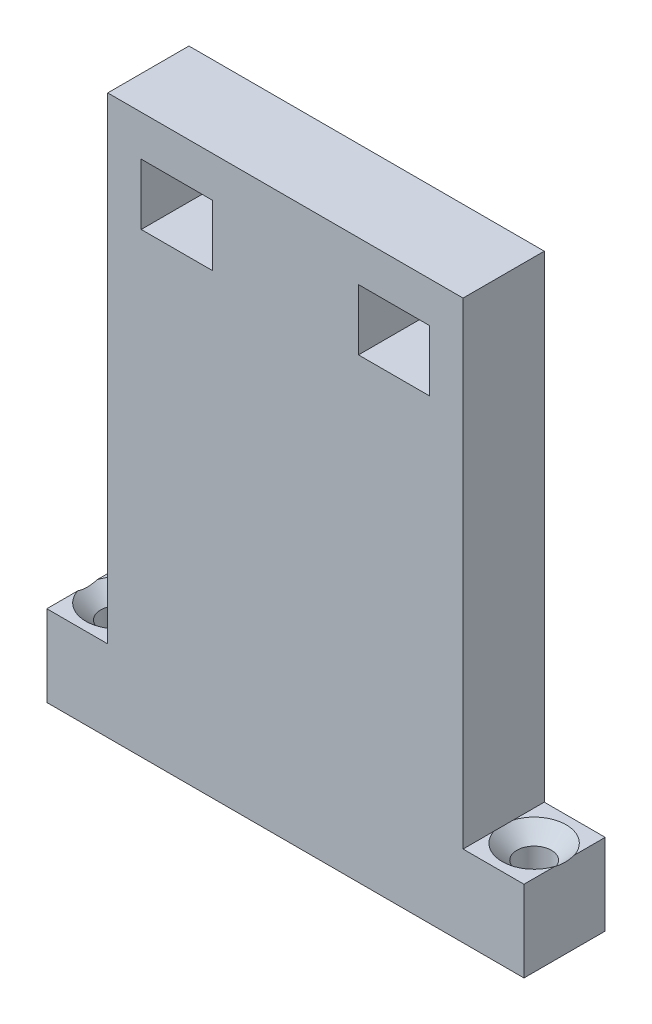
ISO-10303-21;
HEADER;
FILE_DESCRIPTION(('STEP AP214'),'2;1');
FILE_NAME('part.step','',(''),(''),'','','');
FILE_SCHEMA(('AUTOMOTIVE_DESIGN { 1 0 10303 214 1 1 1 1 }'));
ENDSEC;
DATA;
#1=APPLICATION_CONTEXT('core data for automotive mechanical design processes');
#2=APPLICATION_PROTOCOL_DEFINITION('international standard','automotive_design',2000,#1);
#3=PRODUCT_CONTEXT('',#1,'mechanical');
#4=PRODUCT('Part','Part','',(#3));
#5=PRODUCT_RELATED_PRODUCT_CATEGORY('part','',(#4));
#6=PRODUCT_DEFINITION_FORMATION('','',#4);
#7=PRODUCT_DEFINITION_CONTEXT('part definition',#1,'design');
#8=PRODUCT_DEFINITION('design','',#6,#7);
#9=PRODUCT_DEFINITION_SHAPE('','',#8);
#10=(LENGTH_UNIT() NAMED_UNIT(*) SI_UNIT(.MILLI.,.METRE.));
#11=(NAMED_UNIT(*) PLANE_ANGLE_UNIT() SI_UNIT($,.RADIAN.));
#12=(NAMED_UNIT(*) SI_UNIT($,.STERADIAN.) SOLID_ANGLE_UNIT());
#13=UNCERTAINTY_MEASURE_WITH_UNIT(LENGTH_MEASURE(1.E-05),#10,'distance_accuracy_value','');
#14=(GEOMETRIC_REPRESENTATION_CONTEXT(3) GLOBAL_UNCERTAINTY_ASSIGNED_CONTEXT((#13)) GLOBAL_UNIT_ASSIGNED_CONTEXT((#10,
#11,#12)) REPRESENTATION_CONTEXT('',''));
#15=CARTESIAN_POINT('',(0.,0.,0.));
#16=DIRECTION('',(0.,0.,1.));
#17=DIRECTION('',(1.,0.,0.));
#18=AXIS2_PLACEMENT_3D('',#15,#16,#17);
#19=CARTESIAN_POINT('',(-23.5,8.,8.));
#20=DIRECTION('',(0.,-1.,0.));
#21=DIRECTION('',(0.,0.,-1.));
#22=AXIS2_PLACEMENT_3D('',#19,#20,#21);
#23=PLANE('',#22);
#24=DIRECTION('',(0.,0.,-1.));
#25=VECTOR('',#24,1.);
#26=CARTESIAN_POINT('',(-17.5,8.,8.));
#27=LINE('',#26,#25);
#28=CARTESIAN_POINT('',(-17.5,8.,8.));
#29=VERTEX_POINT('',#28);
#30=CARTESIAN_POINT('',(-17.5,8.,4.96046863561493));
#31=VERTEX_POINT('',#30);
#32=EDGE_CURVE('E192',#29,#31,#27,.T.);
#33=ORIENTED_EDGE('',*,*,#32,.T.);
#34=CARTESIAN_POINT('',(-20.5,8.,4.));
#35=DIRECTION('',(0.,1.,0.));
#36=DIRECTION('',(0.,0.,1.));
#37=AXIS2_PLACEMENT_3D('',#34,#35,#36);
#38=CIRCLE('',#37,3.15);
#39=CARTESIAN_POINT('',(-23.5,8.,4.96046863561493));
#40=VERTEX_POINT('',#39);
#41=EDGE_CURVE('E171',#40,#31,#38,.T.);
#42=ORIENTED_EDGE('',*,*,#41,.F.);
#43=DIRECTION('',(0.,0.,-1.));
#44=VECTOR('',#43,1.);
#45=CARTESIAN_POINT('',(-23.5,8.,8.));
#46=LINE('',#45,#44);
#47=CARTESIAN_POINT('',(-23.5,8.,8.));
#48=VERTEX_POINT('',#47);
#49=EDGE_CURVE('E202',#48,#40,#46,.T.);
#50=ORIENTED_EDGE('',*,*,#49,.F.);
#51=DIRECTION('',(-1.,0.,0.));
#52=VECTOR('',#51,1.);
#53=CARTESIAN_POINT('',(-23.5,8.,8.));
#54=LINE('',#53,#52);
#55=EDGE_CURVE('E196',#29,#48,#54,.T.);
#56=ORIENTED_EDGE('',*,*,#55,.F.);
#57=EDGE_LOOP('',(#33,#42,#50,#56));
#58=FACE_BOUND('',#57,.T.);
#59=ADVANCED_FACE('F33',(#58),#23,.F.);
#60=CARTESIAN_POINT('',(23.5,8.,8.));
#61=DIRECTION('',(0.,-1.,0.));
#62=DIRECTION('',(0.,0.,-1.));
#63=AXIS2_PLACEMENT_3D('',#60,#61,#62);
#64=PLANE('',#63);
#65=DIRECTION('',(0.,0.,-1.));
#66=VECTOR('',#65,1.);
#67=CARTESIAN_POINT('',(23.5,8.,8.));
#68=LINE('',#67,#66);
#69=CARTESIAN_POINT('',(23.5,8.,8.));
#70=VERTEX_POINT('',#69);
#71=CARTESIAN_POINT('',(23.5,8.,4.96046863561493));
#72=VERTEX_POINT('',#71);
#73=EDGE_CURVE('E527',#70,#72,#68,.T.);
#74=ORIENTED_EDGE('',*,*,#73,.T.);
#75=CARTESIAN_POINT('',(20.5,8.,4.));
#76=DIRECTION('',(0.,1.,0.));
#77=DIRECTION('',(0.,0.,1.));
#78=AXIS2_PLACEMENT_3D('',#75,#76,#77);
#79=CIRCLE('',#78,3.15);
#80=CARTESIAN_POINT('',(17.5,8.,4.96046863561493));
#81=VERTEX_POINT('',#80);
#82=EDGE_CURVE('E57',#81,#72,#79,.T.);
#83=ORIENTED_EDGE('',*,*,#82,.F.);
#84=DIRECTION('',(0.,0.,-1.));
#85=VECTOR('',#84,1.);
#86=CARTESIAN_POINT('',(17.5,8.,8.));
#87=LINE('',#86,#85);
#88=CARTESIAN_POINT('',(17.5,8.,8.));
#89=VERTEX_POINT('',#88);
#90=EDGE_CURVE('E524',#89,#81,#87,.T.);
#91=ORIENTED_EDGE('',*,*,#90,.F.);
#92=DIRECTION('',(-1.,0.,0.));
#93=VECTOR('',#92,1.);
#94=CARTESIAN_POINT('',(23.5,8.,8.));
#95=LINE('',#94,#93);
#96=EDGE_CURVE('E237',#70,#89,#95,.T.);
#97=ORIENTED_EDGE('',*,*,#96,.F.);
#98=EDGE_LOOP('',(#74,#83,#91,#97));
#99=FACE_BOUND('',#98,.T.);
#100=ADVANCED_FACE('F370',(#99),#64,.F.);
#101=CARTESIAN_POINT('',(0.,0.,8.));
#102=DIRECTION('',(0.,0.,-1.));
#103=DIRECTION('',(-1.,0.,0.));
#104=AXIS2_PLACEMENT_3D('',#101,#102,#103);
#105=PLANE('',#104);
#106=DIRECTION('',(0.,-1.,0.));
#107=VECTOR('',#106,1.);
#108=CARTESIAN_POINT('',(-14.2,51.,8.));
#109=LINE('',#108,#107);
#110=CARTESIAN_POINT('',(-14.2,51.,8.));
#111=VERTEX_POINT('',#110);
#112=CARTESIAN_POINT('',(-14.2,45.,8.));
#113=VERTEX_POINT('',#112);
#114=EDGE_CURVE('E258',#111,#113,#109,.T.);
#115=ORIENTED_EDGE('',*,*,#114,.F.);
#116=DIRECTION('',(-1.,0.,0.));
#117=VECTOR('',#116,1.);
#118=CARTESIAN_POINT('',(-14.2,51.,8.));
#119=LINE('',#118,#117);
#120=CARTESIAN_POINT('',(-7.2,51.,8.));
#121=VERTEX_POINT('',#120);
#122=EDGE_CURVE('E254',#121,#111,#119,.T.);
#123=ORIENTED_EDGE('',*,*,#122,.F.);
#124=DIRECTION('',(0.,1.,0.));
#125=VECTOR('',#124,1.);
#126=CARTESIAN_POINT('',(-7.2,51.,8.));
#127=LINE('',#126,#125);
#128=CARTESIAN_POINT('',(-7.2,45.,8.));
#129=VERTEX_POINT('',#128);
#130=EDGE_CURVE('E270',#129,#121,#127,.T.);
#131=ORIENTED_EDGE('',*,*,#130,.F.);
#132=DIRECTION('',(1.,0.,0.));
#133=VECTOR('',#132,1.);
#134=CARTESIAN_POINT('',(-14.2,45.,8.));
#135=LINE('',#134,#133);
#136=EDGE_CURVE('E273',#113,#129,#135,.T.);
#137=ORIENTED_EDGE('',*,*,#136,.F.);
#138=EDGE_LOOP('',(#115,#123,#131,#137));
#139=FACE_BOUND('',#138,.T.);
#140=DIRECTION('',(0.,-1.,0.));
#141=VECTOR('',#140,1.);
#142=CARTESIAN_POINT('',(-23.5,0.,8.));
#143=LINE('',#142,#141);
#144=CARTESIAN_POINT('',(-23.5,0.,8.));
#145=VERTEX_POINT('',#144);
#146=EDGE_CURVE('E211',#48,#145,#143,.T.);
#147=ORIENTED_EDGE('',*,*,#146,.T.);
#148=DIRECTION('',(1.,0.,0.));
#149=VECTOR('',#148,1.);
#150=CARTESIAN_POINT('',(23.5,0.,8.));
#151=LINE('',#150,#149);
#152=CARTESIAN_POINT('',(23.5,0.,8.));
#153=VERTEX_POINT('',#152);
#154=EDGE_CURVE('E241',#145,#153,#151,.T.);
#155=ORIENTED_EDGE('',*,*,#154,.T.);
#156=DIRECTION('',(0.,1.,0.));
#157=VECTOR('',#156,1.);
#158=CARTESIAN_POINT('',(23.5,0.,8.));
#159=LINE('',#158,#157);
#160=EDGE_CURVE('E239',#153,#70,#159,.T.);
#161=ORIENTED_EDGE('',*,*,#160,.T.);
#162=ORIENTED_EDGE('',*,*,#96,.T.);
#163=DIRECTION('',(0.,1.,0.));
#164=VECTOR('',#163,1.);
#165=CARTESIAN_POINT('',(17.5,8.,8.));
#166=LINE('',#165,#164);
#167=CARTESIAN_POINT('',(17.5,55.,8.));
#168=VERTEX_POINT('',#167);
#169=EDGE_CURVE('E235',#89,#168,#166,.T.);
#170=ORIENTED_EDGE('',*,*,#169,.T.);
#171=DIRECTION('',(-1.,0.,0.));
#172=VECTOR('',#171,1.);
#173=CARTESIAN_POINT('',(-17.5,55.,8.));
#174=LINE('',#173,#172);
#175=CARTESIAN_POINT('',(-17.5,55.,8.));
#176=VERTEX_POINT('',#175);
#177=EDGE_CURVE('E233',#168,#176,#174,.T.);
#178=ORIENTED_EDGE('',*,*,#177,.T.);
#179=DIRECTION('',(0.,-1.,0.));
#180=VECTOR('',#179,1.);
#181=CARTESIAN_POINT('',(-17.5,8.,8.));
#182=LINE('',#181,#180);
#183=EDGE_CURVE('E231',#176,#29,#182,.T.);
#184=ORIENTED_EDGE('',*,*,#183,.T.);
#185=ORIENTED_EDGE('',*,*,#55,.T.);
#186=EDGE_LOOP('',(#147,#155,#161,#162,#170,#178,#184,#185));
#187=FACE_BOUND('',#186,.T.);
#188=DIRECTION('',(-1.,0.,0.));
#189=VECTOR('',#188,1.);
#190=CARTESIAN_POINT('',(14.2,51.,8.));
#191=LINE('',#190,#189);
#192=CARTESIAN_POINT('',(14.2,51.,8.));
#193=VERTEX_POINT('',#192);
#194=CARTESIAN_POINT('',(7.2,51.,8.));
#195=VERTEX_POINT('',#194);
#196=EDGE_CURVE('E289',#193,#195,#191,.T.);
#197=ORIENTED_EDGE('',*,*,#196,.F.);
#198=DIRECTION('',(0.,1.,0.));
#199=VECTOR('',#198,1.);
#200=CARTESIAN_POINT('',(14.2,51.,8.));
#201=LINE('',#200,#199);
#202=CARTESIAN_POINT('',(14.2,45.,8.));
#203=VERTEX_POINT('',#202);
#204=EDGE_CURVE('E285',#203,#193,#201,.T.);
#205=ORIENTED_EDGE('',*,*,#204,.F.);
#206=DIRECTION('',(1.,0.,0.));
#207=VECTOR('',#206,1.);
#208=CARTESIAN_POINT('',(14.2,45.,8.));
#209=LINE('',#208,#207);
#210=CARTESIAN_POINT('',(7.2,45.,8.));
#211=VERTEX_POINT('',#210);
#212=EDGE_CURVE('E301',#211,#203,#209,.T.);
#213=ORIENTED_EDGE('',*,*,#212,.F.);
#214=DIRECTION('',(0.,-1.,0.));
#215=VECTOR('',#214,1.);
#216=CARTESIAN_POINT('',(7.2,51.,8.));
#217=LINE('',#216,#215);
#218=EDGE_CURVE('E304',#195,#211,#217,.T.);
#219=ORIENTED_EDGE('',*,*,#218,.F.);
#220=EDGE_LOOP('',(#197,#205,#213,#219));
#221=FACE_BOUND('',#220,.T.);
#222=ADVANCED_FACE('F366',(#139,#187,#221),#105,.F.);
#223=CARTESIAN_POINT('',(0.,0.,0.));
#224=DIRECTION('',(0.,0.,-1.));
#225=DIRECTION('',(-1.,0.,0.));
#226=AXIS2_PLACEMENT_3D('',#223,#224,#225);
#227=PLANE('',#226);
#228=DIRECTION('',(0.,-1.,0.));
#229=VECTOR('',#228,1.);
#230=CARTESIAN_POINT('',(-23.5,0.,0.));
#231=LINE('',#230,#229);
#232=CARTESIAN_POINT('',(-23.5,8.,0.));
#233=VERTEX_POINT('',#232);
#234=CARTESIAN_POINT('',(-23.5,0.,0.));
#235=VERTEX_POINT('',#234);
#236=EDGE_CURVE('E226',#233,#235,#231,.T.);
#237=ORIENTED_EDGE('',*,*,#236,.F.);
#238=DIRECTION('',(-1.,0.,0.));
#239=VECTOR('',#238,1.);
#240=CARTESIAN_POINT('',(-23.5,8.,0.));
#241=LINE('',#240,#239);
#242=CARTESIAN_POINT('',(-17.5,8.,0.));
#243=VERTEX_POINT('',#242);
#244=EDGE_CURVE('E209',#243,#233,#241,.T.);
#245=ORIENTED_EDGE('',*,*,#244,.F.);
#246=DIRECTION('',(0.,-1.,0.));
#247=VECTOR('',#246,1.);
#248=CARTESIAN_POINT('',(-17.5,8.,0.));
#249=LINE('',#248,#247);
#250=CARTESIAN_POINT('',(-17.5,55.,0.));
#251=VERTEX_POINT('',#250);
#252=EDGE_CURVE('E212',#251,#243,#249,.T.);
#253=ORIENTED_EDGE('',*,*,#252,.F.);
#254=DIRECTION('',(-1.,0.,0.));
#255=VECTOR('',#254,1.);
#256=CARTESIAN_POINT('',(-17.5,55.,0.));
#257=LINE('',#256,#255);
#258=CARTESIAN_POINT('',(17.5,55.,0.));
#259=VERTEX_POINT('',#258);
#260=EDGE_CURVE('E214',#259,#251,#257,.T.);
#261=ORIENTED_EDGE('',*,*,#260,.F.);
#262=DIRECTION('',(0.,1.,0.));
#263=VECTOR('',#262,1.);
#264=CARTESIAN_POINT('',(17.5,8.,0.));
#265=LINE('',#264,#263);
#266=CARTESIAN_POINT('',(17.5,8.,0.));
#267=VERTEX_POINT('',#266);
#268=EDGE_CURVE('E216',#267,#259,#265,.T.);
#269=ORIENTED_EDGE('',*,*,#268,.F.);
#270=DIRECTION('',(-1.,0.,0.));
#271=VECTOR('',#270,1.);
#272=CARTESIAN_POINT('',(23.5,8.,0.));
#273=LINE('',#272,#271);
#274=CARTESIAN_POINT('',(23.5,8.,0.));
#275=VERTEX_POINT('',#274);
#276=EDGE_CURVE('E218',#275,#267,#273,.T.);
#277=ORIENTED_EDGE('',*,*,#276,.F.);
#278=DIRECTION('',(0.,1.,0.));
#279=VECTOR('',#278,1.);
#280=CARTESIAN_POINT('',(23.5,0.,0.));
#281=LINE('',#280,#279);
#282=CARTESIAN_POINT('',(23.5,0.,0.));
#283=VERTEX_POINT('',#282);
#284=EDGE_CURVE('E221',#283,#275,#281,.T.);
#285=ORIENTED_EDGE('',*,*,#284,.F.);
#286=DIRECTION('',(1.,0.,0.));
#287=VECTOR('',#286,1.);
#288=CARTESIAN_POINT('',(23.5,0.,0.));
#289=LINE('',#288,#287);
#290=EDGE_CURVE('E224',#235,#283,#289,.T.);
#291=ORIENTED_EDGE('',*,*,#290,.F.);
#292=EDGE_LOOP('',(#237,#245,#253,#261,#269,#277,#285,#291));
#293=FACE_BOUND('',#292,.T.);
#294=DIRECTION('',(-1.,0.,0.));
#295=VECTOR('',#294,1.);
#296=CARTESIAN_POINT('',(-14.2,51.,0.));
#297=LINE('',#296,#295);
#298=CARTESIAN_POINT('',(-7.2,51.,0.));
#299=VERTEX_POINT('',#298);
#300=CARTESIAN_POINT('',(-14.2,51.,0.));
#301=VERTEX_POINT('',#300);
#302=EDGE_CURVE('E255',#299,#301,#297,.T.);
#303=ORIENTED_EDGE('',*,*,#302,.T.);
#304=DIRECTION('',(0.,-1.,0.));
#305=VECTOR('',#304,1.);
#306=CARTESIAN_POINT('',(-14.2,51.,0.));
#307=LINE('',#306,#305);
#308=CARTESIAN_POINT('',(-14.2,45.,0.));
#309=VERTEX_POINT('',#308);
#310=EDGE_CURVE('E265',#301,#309,#307,.T.);
#311=ORIENTED_EDGE('',*,*,#310,.T.);
#312=DIRECTION('',(1.,0.,0.));
#313=VECTOR('',#312,1.);
#314=CARTESIAN_POINT('',(-14.2,45.,0.));
#315=LINE('',#314,#313);
#316=CARTESIAN_POINT('',(-7.2,45.,0.));
#317=VERTEX_POINT('',#316);
#318=EDGE_CURVE('E262',#309,#317,#315,.T.);
#319=ORIENTED_EDGE('',*,*,#318,.T.);
#320=DIRECTION('',(0.,1.,0.));
#321=VECTOR('',#320,1.);
#322=CARTESIAN_POINT('',(-7.2,51.,0.));
#323=LINE('',#322,#321);
#324=EDGE_CURVE('E259',#317,#299,#323,.T.);
#325=ORIENTED_EDGE('',*,*,#324,.T.);
#326=EDGE_LOOP('',(#303,#311,#319,#325));
#327=FACE_BOUND('',#326,.T.);
#328=DIRECTION('',(0.,1.,0.));
#329=VECTOR('',#328,1.);
#330=CARTESIAN_POINT('',(14.2,51.,0.));
#331=LINE('',#330,#329);
#332=CARTESIAN_POINT('',(14.2,45.,0.));
#333=VERTEX_POINT('',#332);
#334=CARTESIAN_POINT('',(14.2,51.,0.));
#335=VERTEX_POINT('',#334);
#336=EDGE_CURVE('E286',#333,#335,#331,.T.);
#337=ORIENTED_EDGE('',*,*,#336,.T.);
#338=DIRECTION('',(-1.,0.,0.));
#339=VECTOR('',#338,1.);
#340=CARTESIAN_POINT('',(14.2,51.,0.));
#341=LINE('',#340,#339);
#342=CARTESIAN_POINT('',(7.2,51.,0.));
#343=VERTEX_POINT('',#342);
#344=EDGE_CURVE('E296',#335,#343,#341,.T.);
#345=ORIENTED_EDGE('',*,*,#344,.T.);
#346=DIRECTION('',(0.,-1.,0.));
#347=VECTOR('',#346,1.);
#348=CARTESIAN_POINT('',(7.2,51.,0.));
#349=LINE('',#348,#347);
#350=CARTESIAN_POINT('',(7.2,45.,0.));
#351=VERTEX_POINT('',#350);
#352=EDGE_CURVE('E293',#343,#351,#349,.T.);
#353=ORIENTED_EDGE('',*,*,#352,.T.);
#354=DIRECTION('',(1.,0.,0.));
#355=VECTOR('',#354,1.);
#356=CARTESIAN_POINT('',(14.2,45.,0.));
#357=LINE('',#356,#355);
#358=EDGE_CURVE('E290',#351,#333,#357,.T.);
#359=ORIENTED_EDGE('',*,*,#358,.T.);
#360=EDGE_LOOP('',(#337,#345,#353,#359));
#361=FACE_BOUND('',#360,.T.);
#362=ADVANCED_FACE('F369',(#293,#327,#361),#227,.T.);
#363=CARTESIAN_POINT('',(-23.5,0.,8.));
#364=DIRECTION('',(1.,0.,0.));
#365=DIRECTION('',(0.,0.,-1.));
#366=AXIS2_PLACEMENT_3D('',#363,#364,#365);
#367=PLANE('',#366);
#368=ORIENTED_EDGE('',*,*,#49,.T.);
#369=CARTESIAN_POINT('',(-23.5,14.6952486593279,-5.37704223964027));
#370=CARTESIAN_POINT('',(-23.5,14.4843740586763,-5.15561858305818));
#371=CARTESIAN_POINT('',(-23.5,14.2738433583673,-4.93386578474903));
#372=CARTESIAN_POINT('',(-23.5,13.8536773417913,-4.48949552036392));
#373=CARTESIAN_POINT('',(-23.5,13.6440420649191,-4.26687801705079));
#374=CARTESIAN_POINT('',(-23.5,13.2253713241733,-3.82003455453913));
#375=CARTESIAN_POINT('',(-23.5,13.01633866118,-3.59580596823558));
#376=CARTESIAN_POINT('',(-23.5,12.5997284559224,-3.14601184630971));
#377=CARTESIAN_POINT('',(-23.5,12.3921508728783,-2.92044634848514));
#378=CARTESIAN_POINT('',(-23.5,11.955051972803,-2.44146495592533));
#379=CARTESIAN_POINT('',(-23.5,11.7257614823849,-2.18783788872239));
#380=CARTESIAN_POINT('',(-23.5,11.2704455811407,-1.67762132188396));
#381=CARTESIAN_POINT('',(-23.5,11.0444204838787,-1.42103154195073));
#382=CARTESIAN_POINT('',(-23.5,10.5974542560683,-0.904101479107509));
#383=CARTESIAN_POINT('',(-23.5,10.3765060200008,-0.643767387099658));
#384=CARTESIAN_POINT('',(-23.5,10.0506076526672,-0.248738550352719));
#385=CARTESIAN_POINT('',(-23.5,9.94290349070518,-0.116317874293632));
#386=CARTESIAN_POINT('',(-23.5,9.72985048176005,0.150401618555466));
#387=CARTESIAN_POINT('',(-23.5,9.62450152143499,0.284700344458238));
#388=CARTESIAN_POINT('',(-23.5,9.44156921784116,0.523379349251327));
#389=CARTESIAN_POINT('',(-23.5,9.36334733253797,0.627269524612356));
#390=CARTESIAN_POINT('',(-23.5,9.20908789758965,0.836668441271106));
#391=CARTESIAN_POINT('',(-23.5,9.13305041311837,0.942177230718073));
#392=CARTESIAN_POINT('',(-23.5,8.98355241082204,1.15534844551834));
#393=CARTESIAN_POINT('',(-23.5,8.91009770666328,1.26301496753149));
#394=CARTESIAN_POINT('',(-23.5,8.76668493502439,1.48064968233338));
#395=CARTESIAN_POINT('',(-23.5,8.69672668870525,1.59061775699183));
#396=CARTESIAN_POINT('',(-23.5,8.56288848883241,1.81071003857602));
#397=CARTESIAN_POINT('',(-23.5,8.49890434729003,1.92076987981407));
#398=CARTESIAN_POINT('',(-23.5,8.3765119737352,2.14392843057681));
#399=CARTESIAN_POINT('',(-23.5,8.31810533233048,2.25702799526474));
#400=CARTESIAN_POINT('',(-23.5,8.15411681899629,2.60083321273235));
#401=CARTESIAN_POINT('',(-23.5,8.05908052814724,2.83711269473257));
#402=CARTESIAN_POINT('',(-23.5,7.96598284975868,3.15477550904268));
#403=CARTESIAN_POINT('',(-23.5,7.94637750513866,3.22993672799612));
#404=CARTESIAN_POINT('',(-23.5,7.91221849163426,3.38142917574712));
#405=CARTESIAN_POINT('',(-23.5,7.89766555827262,3.4577605732101));
#406=CARTESIAN_POINT('',(-23.5,7.87415480984103,3.61110966550563));
#407=CARTESIAN_POINT('',(-23.5,7.86518428588106,3.68812539359988));
#408=CARTESIAN_POINT('',(-23.5,7.85313800094568,3.84261652378773));
#409=CARTESIAN_POINT('',(-23.5,7.85006201985305,3.9200919086082));
#410=CARTESIAN_POINT('',(-23.5,7.84992852144673,4.08955306867226));
#411=CARTESIAN_POINT('',(-23.5,7.85410439449176,4.18154229604827));
#412=CARTESIAN_POINT('',(-23.5,7.87071560328017,4.36476897840801));
#413=CARTESIAN_POINT('',(-23.5,7.88315225163526,4.45600631158515));
#414=CARTESIAN_POINT('',(-23.5,7.91567448893329,4.63746878779153));
#415=CARTESIAN_POINT('',(-23.5,7.93579060968449,4.72768839107306));
#416=CARTESIAN_POINT('',(-23.5,7.98273350865998,4.90633798926832));
#417=CARTESIAN_POINT('',(-23.5,8.00956073993682,4.99476786292546));
#418=CARTESIAN_POINT('',(-23.5,8.10348442404991,5.27159647060199));
#419=CARTESIAN_POINT('',(-23.5,8.18108705248687,5.45645458127706));
#420=CARTESIAN_POINT('',(-23.5,8.31077482668549,5.72720338479213));
#421=CARTESIAN_POINT('',(-23.5,8.35627532142963,5.81645762198408));
#422=CARTESIAN_POINT('',(-23.5,8.45091312064806,5.99302102353546));
#423=CARTESIAN_POINT('',(-23.5,8.50004985459547,6.08033049024495));
#424=CARTESIAN_POINT('',(-23.5,8.60198623644195,6.25442893216801));
#425=CARTESIAN_POINT('',(-23.5,8.65482785909729,6.34119308373617));
#426=CARTESIAN_POINT('',(-23.5,8.76299212794374,6.51316015363818));
#427=CARTESIAN_POINT('',(-23.5,8.81831483312302,6.59836303478464));
#428=CARTESIAN_POINT('',(-23.5,8.93094656074714,6.7673250839585));
#429=CARTESIAN_POINT('',(-23.5,8.9882536629564,6.85108553637816));
#430=CARTESIAN_POINT('',(-23.5,9.10455905742248,7.01741558099916));
#431=CARTESIAN_POINT('',(-23.5,9.16355728167659,7.09998522088484));
#432=CARTESIAN_POINT('',(-23.5,9.36153651934654,7.37209852149658));
#433=CARTESIAN_POINT('',(-23.5,9.50358924761852,7.55940777501785));
#434=CARTESIAN_POINT('',(-23.5,9.7928438409328,7.93001997470902));
#435=CARTESIAN_POINT('',(-23.5,9.94004663134773,8.11332219117311));
#436=CARTESIAN_POINT('',(-23.5,10.238202142776,8.47700360977533));
#437=CARTESIAN_POINT('',(-23.5,10.3891567878954,8.65738123030408));
#438=CARTESIAN_POINT('',(-23.5,10.6937748935956,9.01583610764546));
#439=CARTESIAN_POINT('',(-23.5,10.8474384361151,9.19391329459136));
#440=CARTESIAN_POINT('',(-23.5,11.1571880869927,9.54870435215426));
#441=CARTESIAN_POINT('',(-23.5,11.3132791538452,9.72541388621864));
#442=CARTESIAN_POINT('',(-23.5,11.6270616542996,10.0774088573119));
#443=CARTESIAN_POINT('',(-23.5,11.7847531126151,10.2526942722738));
#444=CARTESIAN_POINT('',(-23.5,12.2595971941966,10.7767338039151));
#445=CARTESIAN_POINT('',(-23.5,12.5786235171242,11.1237893284714));
#446=CARTESIAN_POINT('',(-23.5,13.1811939094538,11.7731237715883));
#447=CARTESIAN_POINT('',(-23.5,13.4643685050517,12.0757469718862));
#448=CARTESIAN_POINT('',(-23.5,14.0325803773487,12.6792937482194));
#449=CARTESIAN_POINT('',(-23.5,14.317617830015,12.9802171585354));
#450=CARTESIAN_POINT('',(-23.5,14.8877788107061,13.5794298779473));
#451=CARTESIAN_POINT('',(-23.5,15.1728962906006,13.8777249493923));
#452=CARTESIAN_POINT('',(-23.5,15.7441513093984,14.4732727882743));
#453=CARTESIAN_POINT('',(-23.5,16.0302887302064,14.7705256689523));
#454=CARTESIAN_POINT('',(-23.5,16.3168043715839,15.0674117342844));
#455=B_SPLINE_CURVE_WITH_KNOTS('',3,(#369,#370,#371,#372,#373,#374,#375,#376,#377,#378,#379,
#380,#381,#382,#383,#384,#385,#386,#387,#388,#389,#390,#391,#392,#393,#394,#395,#396,#397,#398,
#399,#400,#401,#402,#403,#404,#405,#406,#407,#408,#409,#410,#411,#412,#413,#414,#415,#416,#417,
#418,#419,#420,#421,#422,#423,#424,#425,#426,#427,#428,#429,#430,#431,#432,#433,#434,#435,#436,
#437,#438,#439,#440,#441,#442,#443,#444,#445,#446,#447,#448,#449,#450,#451,#452,#453,#454),
.UNSPECIFIED.,.F.,.F.,(4,2,2,2,2,2,2,2,2,2,2,2,2,2,2,2,2,2,2,2,2,2,2,2,2,2,2,2,2,2,2,2,2,2,2,2,
2,2,2,2,2,2,4),(0.,0.917317453447048,1.83467485767189,2.75432071309026,3.67394069074387,
4.69964192959052,5.72544101681104,6.74970416971808,7.26175804655003,7.77378722797542,
8.16390113643701,8.5540266722867,8.94498045209628,9.33591421465102,9.71766347823607,
10.0995212870838,10.8594445932227,11.0923355516865,11.3252603998776,11.5576530135744,
11.7900369489711,12.0658887920992,12.341784477723,12.6187886810099,12.8958115892993,
13.495527295027,13.796045585967,14.0965168250724,14.4012374587045,14.7059653409674,
15.0104061647049,15.3148347635171,16.0199286173674,16.725149821094,17.4307404745864,
18.1363525075137,18.8436703568315,19.5509991453802,20.9651846462967,22.2085265519687,
23.4519876531173,24.6899055754289,25.9276845402326),.UNSPECIFIED.);
#456=CARTESIAN_POINT('',(-23.5,8.,3.03953136438507));
#457=VERTEX_POINT('',#456);
#458=EDGE_CURVE('E175',#40,#457,#455,.F.);
#459=ORIENTED_EDGE('',*,*,#458,.T.);
#460=EDGE_CURVE('E205',#457,#233,#46,.T.);
#461=ORIENTED_EDGE('',*,*,#460,.T.);
#462=ORIENTED_EDGE('',*,*,#236,.T.);
#463=DIRECTION('',(0.,0.,-1.));
#464=VECTOR('',#463,1.);
#465=CARTESIAN_POINT('',(-23.5,0.,8.));
#466=LINE('',#465,#464);
#467=EDGE_CURVE('E11',#145,#235,#466,.T.);
#468=ORIENTED_EDGE('',*,*,#467,.F.);
#469=ORIENTED_EDGE('',*,*,#146,.F.);
#470=EDGE_LOOP('',(#368,#459,#461,#462,#468,#469));
#471=FACE_BOUND('',#470,.T.);
#472=ADVANCED_FACE('F35',(#471),#367,.F.);
#473=CARTESIAN_POINT('',(23.5,0.,8.));
#474=DIRECTION('',(0.,1.,0.));
#475=DIRECTION('',(0.,0.,1.));
#476=AXIS2_PLACEMENT_3D('',#473,#474,#475);
#477=PLANE('',#476);
#478=CARTESIAN_POINT('',(-20.5,0.,4.));
#479=DIRECTION('',(0.,1.,0.));
#480=DIRECTION('',(0.,0.,1.));
#481=AXIS2_PLACEMENT_3D('',#478,#479,#480);
#482=CIRCLE('',#481,1.7);
#483=CARTESIAN_POINT('',(-20.5,0.,5.7));
#484=VERTEX_POINT('',#483);
#485=EDGE_CURVE('E509',#484,#484,#482,.T.);
#486=ORIENTED_EDGE('',*,*,#485,.T.);
#487=EDGE_LOOP('',(#486));
#488=FACE_BOUND('',#487,.T.);
#489=CARTESIAN_POINT('',(20.5,0.,4.));
#490=DIRECTION('',(0.,1.,0.));
#491=DIRECTION('',(0.,0.,1.));
#492=AXIS2_PLACEMENT_3D('',#489,#490,#491);
#493=CIRCLE('',#492,1.7);
#494=CARTESIAN_POINT('',(20.5,0.,5.7));
#495=VERTEX_POINT('',#494);
#496=EDGE_CURVE('E313',#495,#495,#493,.T.);
#497=ORIENTED_EDGE('',*,*,#496,.T.);
#498=EDGE_LOOP('',(#497));
#499=FACE_BOUND('',#498,.T.);
#500=ORIENTED_EDGE('',*,*,#290,.T.);
#501=DIRECTION('',(0.,0.,-1.));
#502=VECTOR('',#501,1.);
#503=CARTESIAN_POINT('',(23.5,0.,8.));
#504=LINE('',#503,#502);
#505=EDGE_CURVE('E42',#153,#283,#504,.T.);
#506=ORIENTED_EDGE('',*,*,#505,.F.);
#507=ORIENTED_EDGE('',*,*,#154,.F.);
#508=ORIENTED_EDGE('',*,*,#467,.T.);
#509=EDGE_LOOP('',(#500,#506,#507,#508));
#510=FACE_BOUND('',#509,.T.);
#511=ADVANCED_FACE('F392',(#488,#499,#510),#477,.F.);
#512=CARTESIAN_POINT('',(23.5,0.,8.));
#513=DIRECTION('',(-1.,0.,0.));
#514=DIRECTION('',(0.,0.,1.));
#515=AXIS2_PLACEMENT_3D('',#512,#513,#514);
#516=PLANE('',#515);
#517=CARTESIAN_POINT('',(23.5,8.,3.03953136438507));
#518=VERTEX_POINT('',#517);
#519=EDGE_CURVE('E531',#518,#275,#68,.T.);
#520=ORIENTED_EDGE('',*,*,#519,.F.);
#521=CARTESIAN_POINT('',(23.5,14.6952486593279,-5.37704223964027));
#522=CARTESIAN_POINT('',(23.5,14.4843740586763,-5.15561858305818));
#523=CARTESIAN_POINT('',(23.5,14.2738433583673,-4.93386578474903));
#524=CARTESIAN_POINT('',(23.5,13.8536773417913,-4.48949552036392));
#525=CARTESIAN_POINT('',(23.5,13.6440420649191,-4.26687801705079));
#526=CARTESIAN_POINT('',(23.5,13.2253713241733,-3.82003455453913));
#527=CARTESIAN_POINT('',(23.5,13.01633866118,-3.59580596823558));
#528=CARTESIAN_POINT('',(23.5,12.5997284559224,-3.14601184630971));
#529=CARTESIAN_POINT('',(23.5,12.3921508728783,-2.92044634848514));
#530=CARTESIAN_POINT('',(23.5,11.955051972803,-2.44146495592533));
#531=CARTESIAN_POINT('',(23.5,11.7257614823849,-2.18783788872239));
#532=CARTESIAN_POINT('',(23.5,11.2704455811407,-1.67762132188396));
#533=CARTESIAN_POINT('',(23.5,11.0444204838787,-1.42103154195073));
#534=CARTESIAN_POINT('',(23.5,10.5974542560683,-0.904101479107509));
#535=CARTESIAN_POINT('',(23.5,10.3765060200008,-0.643767387099658));
#536=CARTESIAN_POINT('',(23.5,10.0506076526672,-0.248738550352719));
#537=CARTESIAN_POINT('',(23.5,9.94290349070518,-0.116317874293632));
#538=CARTESIAN_POINT('',(23.5,9.72985048176005,0.150401618555466));
#539=CARTESIAN_POINT('',(23.5,9.62450152143499,0.284700344458238));
#540=CARTESIAN_POINT('',(23.5,9.44156921784116,0.523379349251327));
#541=CARTESIAN_POINT('',(23.5,9.36334733253797,0.627269524612356));
#542=CARTESIAN_POINT('',(23.5,9.20908789758965,0.836668441271106));
#543=CARTESIAN_POINT('',(23.5,9.13305041311837,0.942177230718073));
#544=CARTESIAN_POINT('',(23.5,8.98355241082204,1.15534844551834));
#545=CARTESIAN_POINT('',(23.5,8.91009770666328,1.26301496753149));
#546=CARTESIAN_POINT('',(23.5,8.76668493502439,1.48064968233338));
#547=CARTESIAN_POINT('',(23.5,8.69672668870525,1.59061775699183));
#548=CARTESIAN_POINT('',(23.5,8.56288848883241,1.81071003857602));
#549=CARTESIAN_POINT('',(23.5,8.49890434729003,1.92076987981407));
#550=CARTESIAN_POINT('',(23.5,8.3765119737352,2.14392843057681));
#551=CARTESIAN_POINT('',(23.5,8.31810533233048,2.25702799526474));
#552=CARTESIAN_POINT('',(23.5,8.15411681899629,2.60083321273235));
#553=CARTESIAN_POINT('',(23.5,8.05908052814724,2.83711269473257));
#554=CARTESIAN_POINT('',(23.5,7.96598284975868,3.15477550904268));
#555=CARTESIAN_POINT('',(23.5,7.94637750513866,3.22993672799612));
#556=CARTESIAN_POINT('',(23.5,7.91221849163426,3.38142917574712));
#557=CARTESIAN_POINT('',(23.5,7.89766555827262,3.4577605732101));
#558=CARTESIAN_POINT('',(23.5,7.87415480984103,3.61110966550563));
#559=CARTESIAN_POINT('',(23.5,7.86518428588106,3.68812539359988));
#560=CARTESIAN_POINT('',(23.5,7.85313800094568,3.84261652378773));
#561=CARTESIAN_POINT('',(23.5,7.85006201985305,3.9200919086082));
#562=CARTESIAN_POINT('',(23.5,7.84992852144673,4.08955306867226));
#563=CARTESIAN_POINT('',(23.5,7.85410439449176,4.18154229604827));
#564=CARTESIAN_POINT('',(23.5,7.87071560328017,4.36476897840801));
#565=CARTESIAN_POINT('',(23.5,7.88315225163526,4.45600631158515));
#566=CARTESIAN_POINT('',(23.5,7.91567448893329,4.63746878779153));
#567=CARTESIAN_POINT('',(23.5,7.93579060968449,4.72768839107306));
#568=CARTESIAN_POINT('',(23.5,7.98273350865998,4.90633798926832));
#569=CARTESIAN_POINT('',(23.5,8.00956073993682,4.99476786292546));
#570=CARTESIAN_POINT('',(23.5,8.10348442404991,5.27159647060199));
#571=CARTESIAN_POINT('',(23.5,8.18108705248687,5.45645458127706));
#572=CARTESIAN_POINT('',(23.5,8.31077482668549,5.72720338479213));
#573=CARTESIAN_POINT('',(23.5,8.35627532142963,5.81645762198408));
#574=CARTESIAN_POINT('',(23.5,8.45091312064806,5.99302102353546));
#575=CARTESIAN_POINT('',(23.5,8.50004985459547,6.08033049024495));
#576=CARTESIAN_POINT('',(23.5,8.60198623644195,6.25442893216801));
#577=CARTESIAN_POINT('',(23.5,8.65482785909729,6.34119308373617));
#578=CARTESIAN_POINT('',(23.5,8.76299212794374,6.51316015363818));
#579=CARTESIAN_POINT('',(23.5,8.81831483312302,6.59836303478464));
#580=CARTESIAN_POINT('',(23.5,8.93094656074714,6.7673250839585));
#581=CARTESIAN_POINT('',(23.5,8.9882536629564,6.85108553637816));
#582=CARTESIAN_POINT('',(23.5,9.10455905742248,7.01741558099916));
#583=CARTESIAN_POINT('',(23.5,9.16355728167659,7.09998522088484));
#584=CARTESIAN_POINT('',(23.5,9.36153651934654,7.37209852149658));
#585=CARTESIAN_POINT('',(23.5,9.50358924761852,7.55940777501785));
#586=CARTESIAN_POINT('',(23.5,9.7928438409328,7.93001997470902));
#587=CARTESIAN_POINT('',(23.5,9.94004663134773,8.11332219117311));
#588=CARTESIAN_POINT('',(23.5,10.238202142776,8.47700360977533));
#589=CARTESIAN_POINT('',(23.5,10.3891567878954,8.65738123030408));
#590=CARTESIAN_POINT('',(23.5,10.6937748935956,9.01583610764546));
#591=CARTESIAN_POINT('',(23.5,10.8474384361151,9.19391329459136));
#592=CARTESIAN_POINT('',(23.5,11.1571880869927,9.54870435215426));
#593=CARTESIAN_POINT('',(23.5,11.3132791538452,9.72541388621864));
#594=CARTESIAN_POINT('',(23.5,11.6270616542996,10.0774088573119));
#595=CARTESIAN_POINT('',(23.5,11.7847531126151,10.2526942722738));
#596=CARTESIAN_POINT('',(23.5,12.2595971941966,10.7767338039151));
#597=CARTESIAN_POINT('',(23.5,12.5786235171242,11.1237893284714));
#598=CARTESIAN_POINT('',(23.5,13.1811939094538,11.7731237715883));
#599=CARTESIAN_POINT('',(23.5,13.4643685050517,12.0757469718862));
#600=CARTESIAN_POINT('',(23.5,14.0325803773487,12.6792937482194));
#601=CARTESIAN_POINT('',(23.5,14.317617830015,12.9802171585354));
#602=CARTESIAN_POINT('',(23.5,14.8877788107061,13.5794298779473));
#603=CARTESIAN_POINT('',(23.5,15.1728962906006,13.8777249493923));
#604=CARTESIAN_POINT('',(23.5,15.7441513093984,14.4732727882743));
#605=CARTESIAN_POINT('',(23.5,16.0302887302064,14.7705256689523));
#606=CARTESIAN_POINT('',(23.5,16.3168043715839,15.0674117342844));
#607=B_SPLINE_CURVE_WITH_KNOTS('',3,(#521,#522,#523,#524,#525,#526,#527,#528,#529,#530,#531,
#532,#533,#534,#535,#536,#537,#538,#539,#540,#541,#542,#543,#544,#545,#546,#547,#548,#549,#550,
#551,#552,#553,#554,#555,#556,#557,#558,#559,#560,#561,#562,#563,#564,#565,#566,#567,#568,#569,
#570,#571,#572,#573,#574,#575,#576,#577,#578,#579,#580,#581,#582,#583,#584,#585,#586,#587,#588,
#589,#590,#591,#592,#593,#594,#595,#596,#597,#598,#599,#600,#601,#602,#603,#604,#605,#606),
.UNSPECIFIED.,.F.,.F.,(4,2,2,2,2,2,2,2,2,2,2,2,2,2,2,2,2,2,2,2,2,2,2,2,2,2,2,2,2,2,2,2,2,2,2,2,
2,2,2,2,2,2,4),(0.,0.917317453447048,1.83467485767189,2.75432071309026,3.67394069074387,
4.69964192959052,5.72544101681104,6.74970416971808,7.26175804655003,7.77378722797542,
8.16390113643701,8.5540266722867,8.94498045209628,9.33591421465102,9.71766347823607,
10.0995212870838,10.8594445932227,11.0923355516865,11.3252603998776,11.5576530135744,
11.7900369489711,12.0658887920992,12.341784477723,12.6187886810099,12.8958115892993,
13.495527295027,13.796045585967,14.0965168250724,14.4012374587045,14.7059653409674,
15.0104061647049,15.3148347635171,16.0199286173674,16.725149821094,17.4307404745864,
18.1363525075137,18.8436703568315,19.5509991453802,20.9651846462967,22.2085265519687,
23.4519876531173,24.6899055754289,25.9276845402326),.UNSPECIFIED.);
#608=EDGE_CURVE('E299',#518,#72,#607,.T.);
#609=ORIENTED_EDGE('',*,*,#608,.T.);
#610=ORIENTED_EDGE('',*,*,#73,.F.);
#611=ORIENTED_EDGE('',*,*,#160,.F.);
#612=ORIENTED_EDGE('',*,*,#505,.T.);
#613=ORIENTED_EDGE('',*,*,#284,.T.);
#614=EDGE_LOOP('',(#520,#609,#610,#611,#612,#613));
#615=FACE_BOUND('',#614,.T.);
#616=ADVANCED_FACE('F315',(#615),#516,.F.);
#617=CARTESIAN_POINT('',(17.5,8.,3.03953136438507));
#618=VERTEX_POINT('',#617);
#619=EDGE_CURVE('E533',#618,#267,#87,.T.);
#620=ORIENTED_EDGE('',*,*,#619,.F.);
#621=EDGE_CURVE('E512',#518,#618,#79,.T.);
#622=ORIENTED_EDGE('',*,*,#621,.F.);
#623=ORIENTED_EDGE('',*,*,#519,.T.);
#624=ORIENTED_EDGE('',*,*,#276,.T.);
#625=EDGE_LOOP('',(#620,#622,#623,#624));
#626=FACE_BOUND('',#625,.T.);
#627=ADVANCED_FACE('F385',(#626),#64,.F.);
#628=CARTESIAN_POINT('',(17.5,8.,8.));
#629=DIRECTION('',(-1.,0.,0.));
#630=DIRECTION('',(0.,0.,1.));
#631=AXIS2_PLACEMENT_3D('',#628,#629,#630);
#632=PLANE('',#631);
#633=ORIENTED_EDGE('',*,*,#268,.T.);
#634=DIRECTION('',(0.,0.,-1.));
#635=VECTOR('',#634,1.);
#636=CARTESIAN_POINT('',(17.5,55.,8.));
#637=LINE('',#636,#635);
#638=EDGE_CURVE('E199',#168,#259,#637,.T.);
#639=ORIENTED_EDGE('',*,*,#638,.F.);
#640=ORIENTED_EDGE('',*,*,#169,.F.);
#641=ORIENTED_EDGE('',*,*,#90,.T.);
#642=EDGE_CURVE('E529',#81,#618,#87,.T.);
#643=ORIENTED_EDGE('',*,*,#642,.T.);
#644=ORIENTED_EDGE('',*,*,#619,.T.);
#645=EDGE_LOOP('',(#633,#639,#640,#641,#643,#644));
#646=FACE_BOUND('',#645,.T.);
#647=ADVANCED_FACE('F382',(#646),#632,.F.);
#648=CARTESIAN_POINT('',(-17.5,55.,8.));
#649=DIRECTION('',(0.,-1.,0.));
#650=DIRECTION('',(0.,0.,-1.));
#651=AXIS2_PLACEMENT_3D('',#648,#649,#650);
#652=PLANE('',#651);
#653=ORIENTED_EDGE('',*,*,#260,.T.);
#654=DIRECTION('',(0.,0.,-1.));
#655=VECTOR('',#654,1.);
#656=CARTESIAN_POINT('',(-17.5,55.,8.));
#657=LINE('',#656,#655);
#658=EDGE_CURVE('E197',#176,#251,#657,.T.);
#659=ORIENTED_EDGE('',*,*,#658,.F.);
#660=ORIENTED_EDGE('',*,*,#177,.F.);
#661=ORIENTED_EDGE('',*,*,#638,.T.);
#662=EDGE_LOOP('',(#653,#659,#660,#661));
#663=FACE_BOUND('',#662,.T.);
#664=ADVANCED_FACE('F379',(#663),#652,.F.);
#665=CARTESIAN_POINT('',(-17.5,8.,8.));
#666=DIRECTION('',(1.,0.,0.));
#667=DIRECTION('',(0.,0.,-1.));
#668=AXIS2_PLACEMENT_3D('',#665,#666,#667);
#669=PLANE('',#668);
#670=ORIENTED_EDGE('',*,*,#252,.T.);
#671=CARTESIAN_POINT('',(-17.5,8.,3.03953136438507));
#672=VERTEX_POINT('',#671);
#673=EDGE_CURVE('E194',#672,#243,#27,.T.);
#674=ORIENTED_EDGE('',*,*,#673,.F.);
#675=EDGE_CURVE('E184',#31,#672,#27,.T.);
#676=ORIENTED_EDGE('',*,*,#675,.F.);
#677=ORIENTED_EDGE('',*,*,#32,.F.);
#678=ORIENTED_EDGE('',*,*,#183,.F.);
#679=ORIENTED_EDGE('',*,*,#658,.T.);
#680=EDGE_LOOP('',(#670,#674,#676,#677,#678,#679));
#681=FACE_BOUND('',#680,.T.);
#682=ADVANCED_FACE('F190',(#681),#669,.F.);
#683=ORIENTED_EDGE('',*,*,#460,.F.);
#684=EDGE_CURVE('E49',#672,#457,#38,.T.);
#685=ORIENTED_EDGE('',*,*,#684,.F.);
#686=ORIENTED_EDGE('',*,*,#673,.T.);
#687=ORIENTED_EDGE('',*,*,#244,.T.);
#688=EDGE_LOOP('',(#683,#685,#686,#687));
#689=FACE_BOUND('',#688,.T.);
#690=ADVANCED_FACE('F364',(#689),#23,.F.);
#691=CARTESIAN_POINT('',(-14.2,51.,8.));
#692=DIRECTION('',(1.,0.,0.));
#693=DIRECTION('',(0.,0.,-1.));
#694=AXIS2_PLACEMENT_3D('',#691,#692,#693);
#695=PLANE('',#694);
#696=ORIENTED_EDGE('',*,*,#310,.F.);
#697=DIRECTION('',(0.,0.,-1.));
#698=VECTOR('',#697,1.);
#699=CARTESIAN_POINT('',(-14.2,51.,8.));
#700=LINE('',#699,#698);
#701=EDGE_CURVE('E251',#111,#301,#700,.T.);
#702=ORIENTED_EDGE('',*,*,#701,.F.);
#703=ORIENTED_EDGE('',*,*,#114,.T.);
#704=DIRECTION('',(0.,0.,-1.));
#705=VECTOR('',#704,1.);
#706=CARTESIAN_POINT('',(-14.2,45.,8.));
#707=LINE('',#706,#705);
#708=EDGE_CURVE('E229',#113,#309,#707,.T.);
#709=ORIENTED_EDGE('',*,*,#708,.T.);
#710=EDGE_LOOP('',(#696,#702,#703,#709));
#711=FACE_BOUND('',#710,.T.);
#712=ADVANCED_FACE('F360',(#711),#695,.T.);
#713=CARTESIAN_POINT('',(-14.2,45.,8.));
#714=DIRECTION('',(0.,1.,0.));
#715=DIRECTION('',(0.,0.,1.));
#716=AXIS2_PLACEMENT_3D('',#713,#714,#715);
#717=PLANE('',#716);
#718=ORIENTED_EDGE('',*,*,#318,.F.);
#719=ORIENTED_EDGE('',*,*,#708,.F.);
#720=ORIENTED_EDGE('',*,*,#136,.T.);
#721=DIRECTION('',(0.,0.,-1.));
#722=VECTOR('',#721,1.);
#723=CARTESIAN_POINT('',(-7.2,45.,8.));
#724=LINE('',#723,#722);
#725=EDGE_CURVE('E247',#129,#317,#724,.T.);
#726=ORIENTED_EDGE('',*,*,#725,.T.);
#727=EDGE_LOOP('',(#718,#719,#720,#726));
#728=FACE_BOUND('',#727,.T.);
#729=ADVANCED_FACE('F356',(#728),#717,.T.);
#730=CARTESIAN_POINT('',(-7.2,51.,8.));
#731=DIRECTION('',(-1.,0.,0.));
#732=DIRECTION('',(0.,-1.,0.));
#733=AXIS2_PLACEMENT_3D('',#730,#731,#732);
#734=PLANE('',#733);
#735=ORIENTED_EDGE('',*,*,#324,.F.);
#736=ORIENTED_EDGE('',*,*,#725,.F.);
#737=ORIENTED_EDGE('',*,*,#130,.T.);
#738=DIRECTION('',(0.,0.,-1.));
#739=VECTOR('',#738,1.);
#740=CARTESIAN_POINT('',(-7.2,51.,8.));
#741=LINE('',#740,#739);
#742=EDGE_CURVE('E249',#121,#299,#741,.T.);
#743=ORIENTED_EDGE('',*,*,#742,.T.);
#744=EDGE_LOOP('',(#735,#736,#737,#743));
#745=FACE_BOUND('',#744,.T.);
#746=ADVANCED_FACE('F352',(#745),#734,.T.);
#747=CARTESIAN_POINT('',(-14.2,51.,8.));
#748=DIRECTION('',(0.,-1.,0.));
#749=DIRECTION('',(0.,0.,-1.));
#750=AXIS2_PLACEMENT_3D('',#747,#748,#749);
#751=PLANE('',#750);
#752=ORIENTED_EDGE('',*,*,#302,.F.);
#753=ORIENTED_EDGE('',*,*,#742,.F.);
#754=ORIENTED_EDGE('',*,*,#122,.T.);
#755=ORIENTED_EDGE('',*,*,#701,.T.);
#756=EDGE_LOOP('',(#752,#753,#754,#755));
#757=FACE_BOUND('',#756,.T.);
#758=ADVANCED_FACE('F348',(#757),#751,.T.);
#759=CARTESIAN_POINT('',(14.2,51.,8.));
#760=DIRECTION('',(0.,-1.,0.));
#761=DIRECTION('',(0.,0.,-1.));
#762=AXIS2_PLACEMENT_3D('',#759,#760,#761);
#763=PLANE('',#762);
#764=ORIENTED_EDGE('',*,*,#344,.F.);
#765=DIRECTION('',(0.,0.,-1.));
#766=VECTOR('',#765,1.);
#767=CARTESIAN_POINT('',(14.2,51.,8.));
#768=LINE('',#767,#766);
#769=EDGE_CURVE('E282',#193,#335,#768,.T.);
#770=ORIENTED_EDGE('',*,*,#769,.F.);
#771=ORIENTED_EDGE('',*,*,#196,.T.);
#772=DIRECTION('',(0.,0.,-1.));
#773=VECTOR('',#772,1.);
#774=CARTESIAN_POINT('',(7.2,51.,8.));
#775=LINE('',#774,#773);
#776=EDGE_CURVE('E268',#195,#343,#775,.T.);
#777=ORIENTED_EDGE('',*,*,#776,.T.);
#778=EDGE_LOOP('',(#764,#770,#771,#777));
#779=FACE_BOUND('',#778,.T.);
#780=ADVANCED_FACE('F344',(#779),#763,.T.);
#781=CARTESIAN_POINT('',(7.2,51.,8.));
#782=DIRECTION('',(1.,0.,0.));
#783=DIRECTION('',(0.,1.,0.));
#784=AXIS2_PLACEMENT_3D('',#781,#782,#783);
#785=PLANE('',#784);
#786=ORIENTED_EDGE('',*,*,#352,.F.);
#787=ORIENTED_EDGE('',*,*,#776,.F.);
#788=ORIENTED_EDGE('',*,*,#218,.T.);
#789=DIRECTION('',(0.,0.,-1.));
#790=VECTOR('',#789,1.);
#791=CARTESIAN_POINT('',(7.2,45.,8.));
#792=LINE('',#791,#790);
#793=EDGE_CURVE('E278',#211,#351,#792,.T.);
#794=ORIENTED_EDGE('',*,*,#793,.T.);
#795=EDGE_LOOP('',(#786,#787,#788,#794));
#796=FACE_BOUND('',#795,.T.);
#797=ADVANCED_FACE('F340',(#796),#785,.T.);
#798=CARTESIAN_POINT('',(14.2,45.,8.));
#799=DIRECTION('',(0.,1.,0.));
#800=DIRECTION('',(0.,0.,1.));
#801=AXIS2_PLACEMENT_3D('',#798,#799,#800);
#802=PLANE('',#801);
#803=ORIENTED_EDGE('',*,*,#358,.F.);
#804=ORIENTED_EDGE('',*,*,#793,.F.);
#805=ORIENTED_EDGE('',*,*,#212,.T.);
#806=DIRECTION('',(0.,0.,-1.));
#807=VECTOR('',#806,1.);
#808=CARTESIAN_POINT('',(14.2,45.,8.));
#809=LINE('',#808,#807);
#810=EDGE_CURVE('E280',#203,#333,#809,.T.);
#811=ORIENTED_EDGE('',*,*,#810,.T.);
#812=EDGE_LOOP('',(#803,#804,#805,#811));
#813=FACE_BOUND('',#812,.T.);
#814=ADVANCED_FACE('F336',(#813),#802,.T.);
#815=CARTESIAN_POINT('',(14.2,51.,8.));
#816=DIRECTION('',(-1.,0.,0.));
#817=DIRECTION('',(0.,0.,1.));
#818=AXIS2_PLACEMENT_3D('',#815,#816,#817);
#819=PLANE('',#818);
#820=ORIENTED_EDGE('',*,*,#336,.F.);
#821=ORIENTED_EDGE('',*,*,#810,.F.);
#822=ORIENTED_EDGE('',*,*,#204,.T.);
#823=ORIENTED_EDGE('',*,*,#769,.T.);
#824=EDGE_LOOP('',(#820,#821,#822,#823));
#825=FACE_BOUND('',#824,.T.);
#826=ADVANCED_FACE('F332',(#825),#819,.T.);
#827=CARTESIAN_POINT('',(23.65,8.,4.));
#828=DIRECTION('',(0.,1.,0.));
#829=DIRECTION('',(0.,0.,1.));
#830=AXIS2_PLACEMENT_3D('',#827,#828,#829);
#831=PLANE('',#830);
#832=EDGE_CURVE('E511',#618,#81,#79,.T.);
#833=ORIENTED_EDGE('',*,*,#832,.F.);
#834=ORIENTED_EDGE('',*,*,#642,.F.);
#835=EDGE_LOOP('',(#833,#834));
#836=FACE_BOUND('',#835,.T.);
#837=ADVANCED_FACE('F324',(#836),#831,.F.);
#838=CARTESIAN_POINT('',(20.5,8.,4.));
#839=DIRECTION('',(0.,1.,0.));
#840=DIRECTION('',(0.,0.,1.));
#841=AXIS2_PLACEMENT_3D('',#838,#839,#840);
#842=CONICAL_SURFACE('',#841,3.15,0.785398163397449);
#843=CARTESIAN_POINT('',(20.5,6.55,4.));
#844=DIRECTION('',(0.,1.,0.));
#845=DIRECTION('',(0.,0.,1.));
#846=AXIS2_PLACEMENT_3D('',#843,#844,#845);
#847=CIRCLE('',#846,1.7);
#848=CARTESIAN_POINT('',(20.5,6.55,5.7));
#849=VERTEX_POINT('',#848);
#850=EDGE_CURVE('E513',#849,#849,#847,.T.);
#851=ORIENTED_EDGE('',*,*,#850,.F.);
#852=EDGE_LOOP('',(#851));
#853=FACE_BOUND('',#852,.T.);
#854=ORIENTED_EDGE('',*,*,#621,.T.);
#855=ORIENTED_EDGE('',*,*,#832,.T.);
#856=ORIENTED_EDGE('',*,*,#82,.T.);
#857=ORIENTED_EDGE('',*,*,#608,.F.);
#858=EDGE_LOOP('',(#854,#855,#856,#857));
#859=FACE_BOUND('',#858,.T.);
#860=ADVANCED_FACE('F318',(#853,#859),#842,.F.);
#861=CARTESIAN_POINT('',(20.5,8.,4.));
#862=DIRECTION('',(0.,1.,0.));
#863=DIRECTION('',(0.,0.,1.));
#864=AXIS2_PLACEMENT_3D('',#861,#862,#863);
#865=CYLINDRICAL_SURFACE('',#864,1.7);
#866=ORIENTED_EDGE('',*,*,#496,.F.);
#867=EDGE_LOOP('',(#866));
#868=FACE_BOUND('',#867,.T.);
#869=ORIENTED_EDGE('',*,*,#850,.T.);
#870=EDGE_LOOP('',(#869));
#871=FACE_BOUND('',#870,.T.);
#872=ADVANCED_FACE('F323',(#868,#871),#865,.F.);
#873=CARTESIAN_POINT('',(-20.5,8.,4.));
#874=DIRECTION('',(0.,1.,0.));
#875=DIRECTION('',(0.,0.,1.));
#876=AXIS2_PLACEMENT_3D('',#873,#874,#875);
#877=CONICAL_SURFACE('',#876,3.15,0.785398163397449);
#878=CARTESIAN_POINT('',(-20.5,6.55,4.));
#879=DIRECTION('',(0.,1.,0.));
#880=DIRECTION('',(0.,0.,1.));
#881=AXIS2_PLACEMENT_3D('',#878,#879,#880);
#882=CIRCLE('',#881,1.7);
#883=CARTESIAN_POINT('',(-20.5,6.55,5.7));
#884=VERTEX_POINT('',#883);
#885=EDGE_CURVE('E185',#884,#884,#882,.T.);
#886=ORIENTED_EDGE('',*,*,#885,.F.);
#887=EDGE_LOOP('',(#886));
#888=FACE_BOUND('',#887,.T.);
#889=ORIENTED_EDGE('',*,*,#41,.T.);
#890=EDGE_CURVE('E174',#31,#672,#38,.T.);
#891=ORIENTED_EDGE('',*,*,#890,.T.);
#892=ORIENTED_EDGE('',*,*,#684,.T.);
#893=ORIENTED_EDGE('',*,*,#458,.F.);
#894=EDGE_LOOP('',(#889,#891,#892,#893));
#895=FACE_BOUND('',#894,.T.);
#896=ADVANCED_FACE('F173',(#888,#895),#877,.F.);
#897=CARTESIAN_POINT('',(-17.35,8.,4.));
#898=DIRECTION('',(0.,1.,0.));
#899=DIRECTION('',(0.,0.,1.));
#900=AXIS2_PLACEMENT_3D('',#897,#898,#899);
#901=PLANE('',#900);
#902=ORIENTED_EDGE('',*,*,#675,.T.);
#903=ORIENTED_EDGE('',*,*,#890,.F.);
#904=EDGE_LOOP('',(#902,#903));
#905=FACE_BOUND('',#904,.T.);
#906=ADVANCED_FACE('F183',(#905),#901,.F.);
#907=CARTESIAN_POINT('',(-20.5,8.,4.));
#908=DIRECTION('',(0.,1.,0.));
#909=DIRECTION('',(0.,0.,1.));
#910=AXIS2_PLACEMENT_3D('',#907,#908,#909);
#911=CYLINDRICAL_SURFACE('',#910,1.7);
#912=ORIENTED_EDGE('',*,*,#485,.F.);
#913=EDGE_LOOP('',(#912));
#914=FACE_BOUND('',#913,.T.);
#915=ORIENTED_EDGE('',*,*,#885,.T.);
#916=EDGE_LOOP('',(#915));
#917=FACE_BOUND('',#916,.T.);
#918=ADVANCED_FACE('F489',(#914,#917),#911,.F.);
#919=CLOSED_SHELL('',(#59,#100,#222,#362,#472,#511,#616,#627,#647,#664,#682,#690,#712,#729,#746,
#758,#780,#797,#814,#826,#837,#860,#872,#896,#906,#918));
#920=MANIFOLD_SOLID_BREP('B2',#919);
#921=ADVANCED_BREP_SHAPE_REPRESENTATION('',(#18,#920),#14);
#922=SHAPE_DEFINITION_REPRESENTATION(#9,#921);
ENDSEC;
END-ISO-10303-21;
